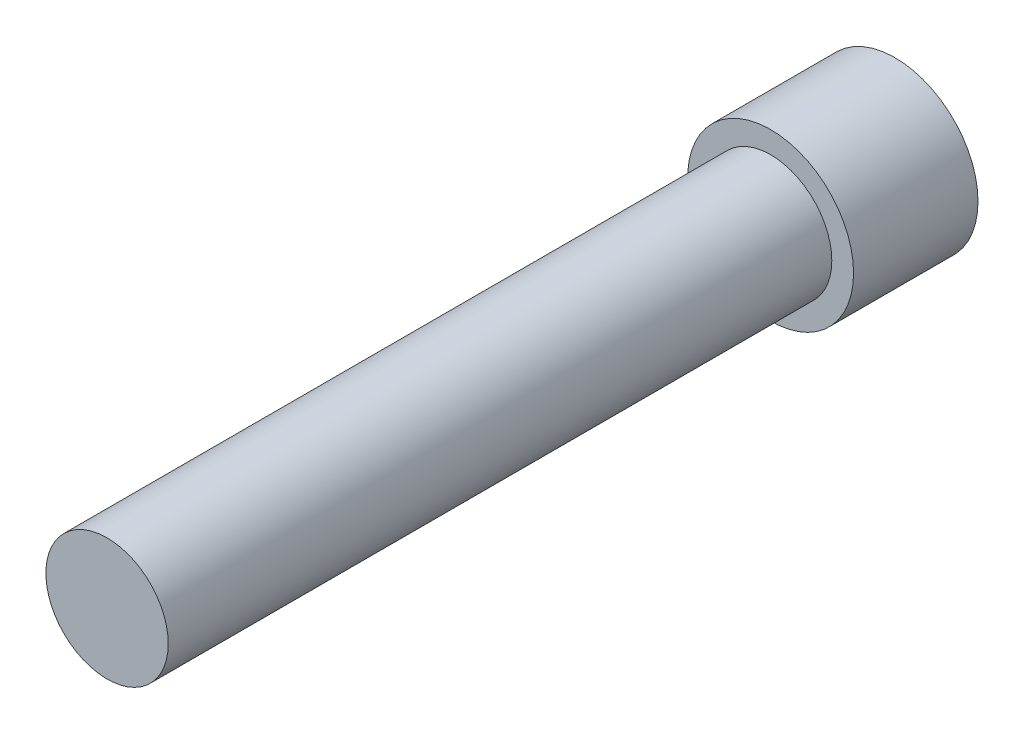
ISO-10303-21;
HEADER;
FILE_DESCRIPTION(('STEP AP214'),'2;1');
FILE_NAME('part.step','',(''),(''),'','','');
FILE_SCHEMA(('AUTOMOTIVE_DESIGN { 1 0 10303 214 1 1 1 1 }'));
ENDSEC;
DATA;
#1=APPLICATION_CONTEXT('core data for automotive mechanical design processes');
#2=APPLICATION_PROTOCOL_DEFINITION('international standard','automotive_design',2000,#1);
#3=PRODUCT_CONTEXT('',#1,'mechanical');
#4=PRODUCT('Part','Part','',(#3));
#5=PRODUCT_RELATED_PRODUCT_CATEGORY('part','',(#4));
#6=PRODUCT_DEFINITION_FORMATION('','',#4);
#7=PRODUCT_DEFINITION_CONTEXT('part definition',#1,'design');
#8=PRODUCT_DEFINITION('design','',#6,#7);
#9=PRODUCT_DEFINITION_SHAPE('','',#8);
#10=(LENGTH_UNIT() NAMED_UNIT(*) SI_UNIT(.MILLI.,.METRE.));
#11=(NAMED_UNIT(*) PLANE_ANGLE_UNIT() SI_UNIT($,.RADIAN.));
#12=(NAMED_UNIT(*) SI_UNIT($,.STERADIAN.) SOLID_ANGLE_UNIT());
#13=UNCERTAINTY_MEASURE_WITH_UNIT(LENGTH_MEASURE(1.E-05),#10,'distance_accuracy_value','');
#14=(GEOMETRIC_REPRESENTATION_CONTEXT(3) GLOBAL_UNCERTAINTY_ASSIGNED_CONTEXT((#13)) GLOBAL_UNIT_ASSIGNED_CONTEXT((#10,
#11,#12)) REPRESENTATION_CONTEXT('',''));
#15=CARTESIAN_POINT('',(0.,0.,0.));
#16=DIRECTION('',(0.,0.,1.));
#17=DIRECTION('',(1.,0.,0.));
#18=AXIS2_PLACEMENT_3D('',#15,#16,#17);
#19=CARTESIAN_POINT('',(0.,0.,3.));
#20=DIRECTION('',(0.,0.,1.));
#21=DIRECTION('',(1.,0.,0.));
#22=AXIS2_PLACEMENT_3D('',#19,#20,#21);
#23=PLANE('',#22);
#24=CARTESIAN_POINT('',(0.,0.,3.));
#25=DIRECTION('',(0.,0.,1.));
#26=DIRECTION('',(1.,0.,0.));
#27=AXIS2_PLACEMENT_3D('',#24,#25,#26);
#28=CIRCLE('',#27,2.);
#29=CARTESIAN_POINT('',(2.,0.,3.));
#30=VERTEX_POINT('',#29);
#31=EDGE_CURVE('E11',#30,#30,#28,.T.);
#32=ORIENTED_EDGE('',*,*,#31,.T.);
#33=EDGE_LOOP('',(#32));
#34=FACE_BOUND('',#33,.T.);
#35=CARTESIAN_POINT('',(0.,0.,3.));
#36=DIRECTION('',(0.,0.,1.));
#37=DIRECTION('',(1.,0.,0.));
#38=AXIS2_PLACEMENT_3D('',#35,#36,#37);
#39=CIRCLE('',#38,1.475);
#40=CARTESIAN_POINT('',(1.475,0.,3.));
#41=VERTEX_POINT('',#40);
#42=EDGE_CURVE('E155',#41,#41,#39,.T.);
#43=ORIENTED_EDGE('',*,*,#42,.F.);
#44=EDGE_LOOP('',(#43));
#45=FACE_BOUND('',#44,.T.);
#46=ADVANCED_FACE('F36',(#34,#45),#23,.T.);
#47=CARTESIAN_POINT('',(0.,0.,3.));
#48=DIRECTION('',(0.,0.,-1.));
#49=DIRECTION('',(-1.,0.,0.));
#50=AXIS2_PLACEMENT_3D('',#47,#48,#49);
#51=CYLINDRICAL_SURFACE('',#50,2.);
#52=ORIENTED_EDGE('',*,*,#31,.F.);
#53=EDGE_LOOP('',(#52));
#54=FACE_BOUND('',#53,.T.);
#55=CARTESIAN_POINT('',(0.,0.,0.));
#56=DIRECTION('',(0.,0.,1.));
#57=DIRECTION('',(1.,0.,0.));
#58=AXIS2_PLACEMENT_3D('',#55,#56,#57);
#59=CIRCLE('',#58,2.);
#60=CARTESIAN_POINT('',(2.,0.,0.));
#61=VERTEX_POINT('',#60);
#62=EDGE_CURVE('E40',#61,#61,#59,.T.);
#63=ORIENTED_EDGE('',*,*,#62,.T.);
#64=EDGE_LOOP('',(#63));
#65=FACE_BOUND('',#64,.T.);
#66=ADVANCED_FACE('F38',(#54,#65),#51,.T.);
#67=CARTESIAN_POINT('',(0.,0.,0.));
#68=DIRECTION('',(0.,0.,1.));
#69=DIRECTION('',(1.,0.,0.));
#70=AXIS2_PLACEMENT_3D('',#67,#68,#69);
#71=PLANE('',#70);
#72=DIRECTION('',(-0.5,-0.866025403784439,0.));
#73=VECTOR('',#72,1.);
#74=CARTESIAN_POINT('',(1.44337567297407,0.,0.));
#75=LINE('',#74,#73);
#76=CARTESIAN_POINT('',(1.44337567297407,0.,0.));
#77=VERTEX_POINT('',#76);
#78=CARTESIAN_POINT('',(0.721687836487033,-1.25,0.));
#79=VERTEX_POINT('',#78);
#80=EDGE_CURVE('E125',#77,#79,#75,.T.);
#81=ORIENTED_EDGE('',*,*,#80,.F.);
#82=DIRECTION('',(0.5,-0.866025403784439,0.));
#83=VECTOR('',#82,1.);
#84=CARTESIAN_POINT('',(0.721687836487033,1.25,0.));
#85=LINE('',#84,#83);
#86=CARTESIAN_POINT('',(0.721687836487033,1.25,0.));
#87=VERTEX_POINT('',#86);
#88=EDGE_CURVE('E51',#87,#77,#85,.T.);
#89=ORIENTED_EDGE('',*,*,#88,.F.);
#90=DIRECTION('',(1.,0.,0.));
#91=VECTOR('',#90,1.);
#92=CARTESIAN_POINT('',(-0.721687836487032,1.25,0.));
#93=LINE('',#92,#91);
#94=CARTESIAN_POINT('',(-0.721687836487032,1.25,0.));
#95=VERTEX_POINT('',#94);
#96=EDGE_CURVE('E135',#95,#87,#93,.T.);
#97=ORIENTED_EDGE('',*,*,#96,.F.);
#98=DIRECTION('',(0.5,0.866025403784438,0.));
#99=VECTOR('',#98,1.);
#100=CARTESIAN_POINT('',(-1.44337567297407,0.,0.));
#101=LINE('',#100,#99);
#102=CARTESIAN_POINT('',(-1.44337567297407,0.,0.));
#103=VERTEX_POINT('',#102);
#104=EDGE_CURVE('E133',#103,#95,#101,.T.);
#105=ORIENTED_EDGE('',*,*,#104,.F.);
#106=DIRECTION('',(-0.5,0.866025403784439,0.));
#107=VECTOR('',#106,1.);
#108=CARTESIAN_POINT('',(-0.721687836487033,-1.25,0.));
#109=LINE('',#108,#107);
#110=CARTESIAN_POINT('',(-0.721687836487033,-1.25,0.));
#111=VERTEX_POINT('',#110);
#112=EDGE_CURVE('E99',#111,#103,#109,.T.);
#113=ORIENTED_EDGE('',*,*,#112,.F.);
#114=DIRECTION('',(-1.,0.,0.));
#115=VECTOR('',#114,1.);
#116=CARTESIAN_POINT('',(0.721687836487033,-1.25,0.));
#117=LINE('',#116,#115);
#118=EDGE_CURVE('E129',#79,#111,#117,.T.);
#119=ORIENTED_EDGE('',*,*,#118,.F.);
#120=EDGE_LOOP('',(#81,#89,#97,#105,#113,#119));
#121=FACE_BOUND('',#120,.T.);
#122=ORIENTED_EDGE('',*,*,#62,.F.);
#123=EDGE_LOOP('',(#122));
#124=FACE_BOUND('',#123,.T.);
#125=ADVANCED_FACE('F148',(#121,#124),#71,.F.);
#126=CARTESIAN_POINT('',(0.721687836487033,1.25,1.82));
#127=DIRECTION('',(0.866025403784439,0.5,0.));
#128=DIRECTION('',(-0.5,0.866025403784439,0.));
#129=AXIS2_PLACEMENT_3D('',#126,#127,#128);
#130=PLANE('',#129);
#131=ORIENTED_EDGE('',*,*,#88,.T.);
#132=DIRECTION('',(0.,0.,-1.));
#133=VECTOR('',#132,1.);
#134=CARTESIAN_POINT('',(1.44337567297407,0.,1.82));
#135=LINE('',#134,#133);
#136=CARTESIAN_POINT('',(1.44337567297407,0.,1.82));
#137=VERTEX_POINT('',#136);
#138=EDGE_CURVE('E81',#137,#77,#135,.T.);
#139=ORIENTED_EDGE('',*,*,#138,.F.);
#140=DIRECTION('',(0.5,-0.866025403784439,0.));
#141=VECTOR('',#140,1.);
#142=CARTESIAN_POINT('',(0.721687836487033,1.25,1.82));
#143=LINE('',#142,#141);
#144=CARTESIAN_POINT('',(0.721687836487033,1.25,1.82));
#145=VERTEX_POINT('',#144);
#146=EDGE_CURVE('E137',#145,#137,#143,.T.);
#147=ORIENTED_EDGE('',*,*,#146,.F.);
#148=DIRECTION('',(0.,0.,-1.));
#149=VECTOR('',#148,1.);
#150=CARTESIAN_POINT('',(0.721687836487033,1.25,1.82));
#151=LINE('',#150,#149);
#152=EDGE_CURVE('E59',#145,#87,#151,.T.);
#153=ORIENTED_EDGE('',*,*,#152,.T.);
#154=EDGE_LOOP('',(#131,#139,#147,#153));
#155=FACE_BOUND('',#154,.T.);
#156=ADVANCED_FACE('F177',(#155),#130,.F.);
#157=CARTESIAN_POINT('',(-0.721687836487032,1.25,1.82));
#158=DIRECTION('',(0.,1.,0.));
#159=DIRECTION('',(0.,0.,1.));
#160=AXIS2_PLACEMENT_3D('',#157,#158,#159);
#161=PLANE('',#160);
#162=ORIENTED_EDGE('',*,*,#96,.T.);
#163=ORIENTED_EDGE('',*,*,#152,.F.);
#164=DIRECTION('',(1.,0.,0.));
#165=VECTOR('',#164,1.);
#166=CARTESIAN_POINT('',(-0.721687836487032,1.25,1.82));
#167=LINE('',#166,#165);
#168=CARTESIAN_POINT('',(-0.721687836487032,1.25,1.82));
#169=VERTEX_POINT('',#168);
#170=EDGE_CURVE('E111',#169,#145,#167,.T.);
#171=ORIENTED_EDGE('',*,*,#170,.F.);
#172=DIRECTION('',(0.,0.,-1.));
#173=VECTOR('',#172,1.);
#174=CARTESIAN_POINT('',(-0.721687836487032,1.25,1.82));
#175=LINE('',#174,#173);
#176=EDGE_CURVE('E103',#169,#95,#175,.T.);
#177=ORIENTED_EDGE('',*,*,#176,.T.);
#178=EDGE_LOOP('',(#162,#163,#171,#177));
#179=FACE_BOUND('',#178,.T.);
#180=ADVANCED_FACE('F183',(#179),#161,.F.);
#181=CARTESIAN_POINT('',(-1.44337567297407,0.,1.82));
#182=DIRECTION('',(-0.866025403784438,0.5,0.));
#183=DIRECTION('',(-0.5,-0.866025403784438,0.));
#184=AXIS2_PLACEMENT_3D('',#181,#182,#183);
#185=PLANE('',#184);
#186=ORIENTED_EDGE('',*,*,#104,.T.);
#187=ORIENTED_EDGE('',*,*,#176,.F.);
#188=DIRECTION('',(0.5,0.866025403784438,0.));
#189=VECTOR('',#188,1.);
#190=CARTESIAN_POINT('',(-1.44337567297407,0.,1.82));
#191=LINE('',#190,#189);
#192=CARTESIAN_POINT('',(-1.44337567297407,0.,1.82));
#193=VERTEX_POINT('',#192);
#194=EDGE_CURVE('E107',#193,#169,#191,.T.);
#195=ORIENTED_EDGE('',*,*,#194,.F.);
#196=DIRECTION('',(0.,0.,-1.));
#197=VECTOR('',#196,1.);
#198=CARTESIAN_POINT('',(-1.44337567297407,0.,1.82));
#199=LINE('',#198,#197);
#200=EDGE_CURVE('E92',#193,#103,#199,.T.);
#201=ORIENTED_EDGE('',*,*,#200,.T.);
#202=EDGE_LOOP('',(#186,#187,#195,#201));
#203=FACE_BOUND('',#202,.T.);
#204=ADVANCED_FACE('F108',(#203),#185,.F.);
#205=CARTESIAN_POINT('',(-0.721687836487033,-1.25,1.82));
#206=DIRECTION('',(-0.866025403784439,-0.5,0.));
#207=DIRECTION('',(0.5,-0.866025403784439,0.));
#208=AXIS2_PLACEMENT_3D('',#205,#206,#207);
#209=PLANE('',#208);
#210=ORIENTED_EDGE('',*,*,#112,.T.);
#211=ORIENTED_EDGE('',*,*,#200,.F.);
#212=DIRECTION('',(-0.5,0.866025403784439,0.));
#213=VECTOR('',#212,1.);
#214=CARTESIAN_POINT('',(-0.721687836487033,-1.25,1.82));
#215=LINE('',#214,#213);
#216=CARTESIAN_POINT('',(-0.721687836487033,-1.25,1.82));
#217=VERTEX_POINT('',#216);
#218=EDGE_CURVE('E96',#217,#193,#215,.T.);
#219=ORIENTED_EDGE('',*,*,#218,.F.);
#220=DIRECTION('',(0.,0.,-1.));
#221=VECTOR('',#220,1.);
#222=CARTESIAN_POINT('',(-0.721687836487033,-1.25,1.82));
#223=LINE('',#222,#221);
#224=EDGE_CURVE('E104',#217,#111,#223,.T.);
#225=ORIENTED_EDGE('',*,*,#224,.T.);
#226=EDGE_LOOP('',(#210,#211,#219,#225));
#227=FACE_BOUND('',#226,.T.);
#228=ADVANCED_FACE('F94',(#227),#209,.F.);
#229=CARTESIAN_POINT('',(0.721687836487033,-1.25,1.82));
#230=DIRECTION('',(0.,-1.,0.));
#231=DIRECTION('',(0.,0.,-1.));
#232=AXIS2_PLACEMENT_3D('',#229,#230,#231);
#233=PLANE('',#232);
#234=ORIENTED_EDGE('',*,*,#118,.T.);
#235=ORIENTED_EDGE('',*,*,#224,.F.);
#236=DIRECTION('',(-1.,0.,0.));
#237=VECTOR('',#236,1.);
#238=CARTESIAN_POINT('',(0.721687836487033,-1.25,1.82));
#239=LINE('',#238,#237);
#240=CARTESIAN_POINT('',(0.721687836487033,-1.25,1.82));
#241=VERTEX_POINT('',#240);
#242=EDGE_CURVE('E117',#241,#217,#239,.T.);
#243=ORIENTED_EDGE('',*,*,#242,.F.);
#244=DIRECTION('',(0.,0.,-1.));
#245=VECTOR('',#244,1.);
#246=CARTESIAN_POINT('',(0.721687836487033,-1.25,1.82));
#247=LINE('',#246,#245);
#248=EDGE_CURVE('E141',#241,#79,#247,.T.);
#249=ORIENTED_EDGE('',*,*,#248,.T.);
#250=EDGE_LOOP('',(#234,#235,#243,#249));
#251=FACE_BOUND('',#250,.T.);
#252=ADVANCED_FACE('F152',(#251),#233,.F.);
#253=CARTESIAN_POINT('',(1.44337567297407,0.,1.82));
#254=DIRECTION('',(0.866025403784439,-0.5,0.));
#255=DIRECTION('',(0.5,0.866025403784439,0.));
#256=AXIS2_PLACEMENT_3D('',#253,#254,#255);
#257=PLANE('',#256);
#258=ORIENTED_EDGE('',*,*,#80,.T.);
#259=ORIENTED_EDGE('',*,*,#248,.F.);
#260=DIRECTION('',(-0.5,-0.866025403784439,0.));
#261=VECTOR('',#260,1.);
#262=CARTESIAN_POINT('',(1.44337567297407,0.,1.82));
#263=LINE('',#262,#261);
#264=EDGE_CURVE('E119',#137,#241,#263,.T.);
#265=ORIENTED_EDGE('',*,*,#264,.F.);
#266=ORIENTED_EDGE('',*,*,#138,.T.);
#267=EDGE_LOOP('',(#258,#259,#265,#266));
#268=FACE_BOUND('',#267,.T.);
#269=ADVANCED_FACE('F145',(#268),#257,.F.);
#270=CARTESIAN_POINT('',(1.44337567297407,0.,1.82));
#271=DIRECTION('',(0.,0.,-1.));
#272=DIRECTION('',(-1.,0.,0.));
#273=AXIS2_PLACEMENT_3D('',#270,#271,#272);
#274=PLANE('',#273);
#275=ORIENTED_EDGE('',*,*,#146,.T.);
#276=ORIENTED_EDGE('',*,*,#264,.T.);
#277=ORIENTED_EDGE('',*,*,#242,.T.);
#278=ORIENTED_EDGE('',*,*,#218,.T.);
#279=ORIENTED_EDGE('',*,*,#194,.T.);
#280=ORIENTED_EDGE('',*,*,#170,.T.);
#281=EDGE_LOOP('',(#275,#276,#277,#278,#279,#280));
#282=FACE_BOUND('',#281,.T.);
#283=ADVANCED_FACE('F114',(#282),#274,.T.);
#284=CARTESIAN_POINT('',(0.,0.,19.));
#285=DIRECTION('',(0.,0.,-1.));
#286=DIRECTION('',(-1.,0.,0.));
#287=AXIS2_PLACEMENT_3D('',#284,#285,#286);
#288=CYLINDRICAL_SURFACE('',#287,1.475);
#289=CARTESIAN_POINT('',(0.,0.,19.));
#290=DIRECTION('',(0.,0.,1.));
#291=DIRECTION('',(1.,0.,0.));
#292=AXIS2_PLACEMENT_3D('',#289,#290,#291);
#293=CIRCLE('',#292,1.475);
#294=CARTESIAN_POINT('',(1.475,0.,19.));
#295=VERTEX_POINT('',#294);
#296=EDGE_CURVE('E126',#295,#295,#293,.T.);
#297=ORIENTED_EDGE('',*,*,#296,.F.);
#298=EDGE_LOOP('',(#297));
#299=FACE_BOUND('',#298,.T.);
#300=ORIENTED_EDGE('',*,*,#42,.T.);
#301=EDGE_LOOP('',(#300));
#302=FACE_BOUND('',#301,.T.);
#303=ADVANCED_FACE('F163',(#299,#302),#288,.T.);
#304=CARTESIAN_POINT('',(0.,0.,19.));
#305=DIRECTION('',(0.,0.,1.));
#306=DIRECTION('',(1.,0.,0.));
#307=AXIS2_PLACEMENT_3D('',#304,#305,#306);
#308=PLANE('',#307);
#309=ORIENTED_EDGE('',*,*,#296,.T.);
#310=EDGE_LOOP('',(#309));
#311=FACE_BOUND('',#310,.T.);
#312=ADVANCED_FACE('F161',(#311),#308,.T.);
#313=CLOSED_SHELL('',(#46,#66,#125,#156,#180,#204,#228,#252,#269,#283,#303,#312));
#314=MANIFOLD_SOLID_BREP('B2',#313);
#315=ADVANCED_BREP_SHAPE_REPRESENTATION('',(#18,#314),#14);
#316=SHAPE_DEFINITION_REPRESENTATION(#9,#315);
ENDSEC;
END-ISO-10303-21;
